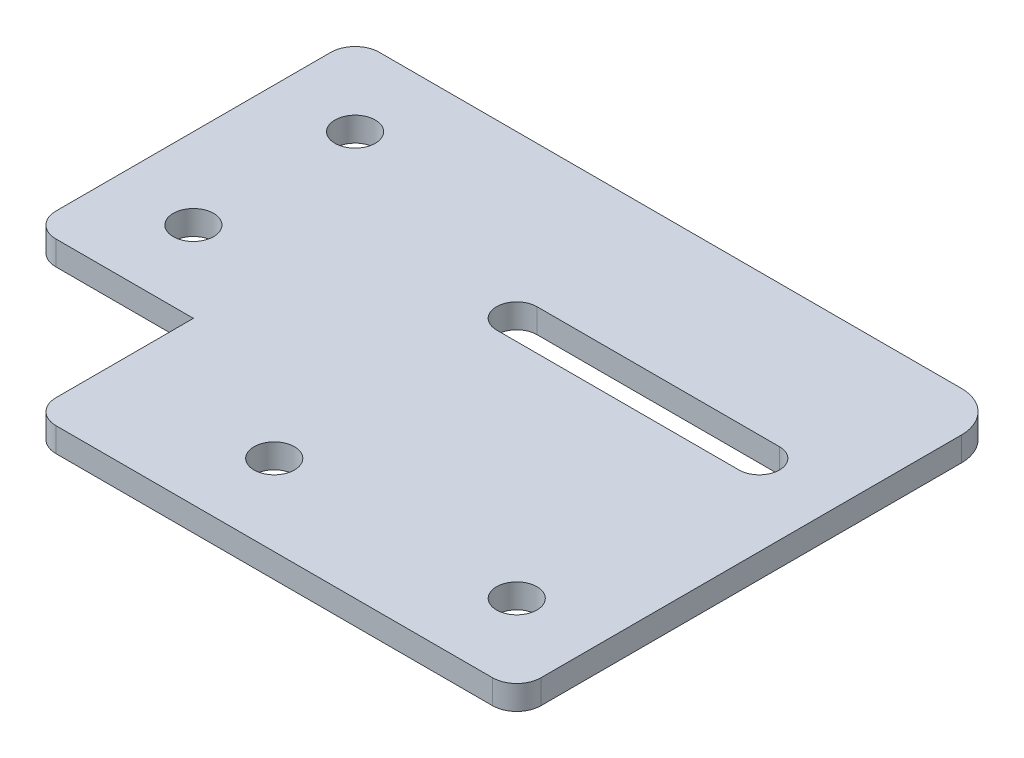
ISO-10303-21;
HEADER;
FILE_DESCRIPTION(('STEP AP214'),'2;1');
FILE_NAME('part.step','',(''),(''),'','','');
FILE_SCHEMA(('AUTOMOTIVE_DESIGN { 1 0 10303 214 1 1 1 1 }'));
ENDSEC;
DATA;
#1=APPLICATION_CONTEXT('core data for automotive mechanical design processes');
#2=APPLICATION_PROTOCOL_DEFINITION('international standard','automotive_design',2000,#1);
#3=PRODUCT_CONTEXT('',#1,'mechanical');
#4=PRODUCT('Part','Part','',(#3));
#5=PRODUCT_RELATED_PRODUCT_CATEGORY('part','',(#4));
#6=PRODUCT_DEFINITION_FORMATION('','',#4);
#7=PRODUCT_DEFINITION_CONTEXT('part definition',#1,'design');
#8=PRODUCT_DEFINITION('design','',#6,#7);
#9=PRODUCT_DEFINITION_SHAPE('','',#8);
#10=(LENGTH_UNIT() NAMED_UNIT(*) SI_UNIT(.MILLI.,.METRE.));
#11=(NAMED_UNIT(*) PLANE_ANGLE_UNIT() SI_UNIT($,.RADIAN.));
#12=(NAMED_UNIT(*) SI_UNIT($,.STERADIAN.) SOLID_ANGLE_UNIT());
#13=UNCERTAINTY_MEASURE_WITH_UNIT(LENGTH_MEASURE(1.E-05),#10,'distance_accuracy_value','');
#14=(GEOMETRIC_REPRESENTATION_CONTEXT(3) GLOBAL_UNCERTAINTY_ASSIGNED_CONTEXT((#13)) GLOBAL_UNIT_ASSIGNED_CONTEXT((#10,
#11,#12)) REPRESENTATION_CONTEXT('',''));
#15=CARTESIAN_POINT('',(0.,0.,0.));
#16=DIRECTION('',(0.,0.,1.));
#17=DIRECTION('',(1.,0.,0.));
#18=AXIS2_PLACEMENT_3D('',#15,#16,#17);
#19=CARTESIAN_POINT('',(23.,3.,0.416071827038649));
#20=DIRECTION('',(0.,-1.,0.));
#21=DIRECTION('',(0.,0.,-1.));
#22=AXIS2_PLACEMENT_3D('',#19,#20,#21);
#23=PLANE('',#22);
#24=CARTESIAN_POINT('',(10.,3.,-46.5839281729614));
#25=DIRECTION('',(0.,1.,0.));
#26=DIRECTION('',(0.,0.,1.));
#27=AXIS2_PLACEMENT_3D('',#24,#25,#26);
#28=CIRCLE('',#27,2.5);
#29=CARTESIAN_POINT('',(10.,3.,-44.0839281729614));
#30=VERTEX_POINT('',#29);
#31=EDGE_CURVE('E177',#30,#30,#28,.T.);
#32=ORIENTED_EDGE('',*,*,#31,.F.);
#33=EDGE_LOOP('',(#32));
#34=FACE_BOUND('',#33,.T.);
#35=CARTESIAN_POINT('',(70.,3.,-6.58392817296135));
#36=DIRECTION('',(0.,1.,0.));
#37=DIRECTION('',(0.,0.,1.));
#38=AXIS2_PLACEMENT_3D('',#35,#36,#37);
#39=CIRCLE('',#38,2.50000000000001);
#40=CARTESIAN_POINT('',(70.,3.,-4.08392817296135));
#41=VERTEX_POINT('',#40);
#42=EDGE_CURVE('E183',#41,#41,#39,.T.);
#43=ORIENTED_EDGE('',*,*,#42,.F.);
#44=EDGE_LOOP('',(#43));
#45=FACE_BOUND('',#44,.T.);
#46=CARTESIAN_POINT('',(40.,3.,-6.58392817296135));
#47=DIRECTION('',(0.,1.,0.));
#48=DIRECTION('',(0.,0.,1.));
#49=AXIS2_PLACEMENT_3D('',#46,#47,#48);
#50=CIRCLE('',#49,2.5);
#51=CARTESIAN_POINT('',(40.,3.,-4.08392817296135));
#52=VERTEX_POINT('',#51);
#53=EDGE_CURVE('E189',#52,#52,#50,.T.);
#54=ORIENTED_EDGE('',*,*,#53,.F.);
#55=EDGE_LOOP('',(#54));
#56=FACE_BOUND('',#55,.T.);
#57=CARTESIAN_POINT('',(10.,3.,-26.5839281729614));
#58=DIRECTION('',(0.,1.,0.));
#59=DIRECTION('',(0.,0.,1.));
#60=AXIS2_PLACEMENT_3D('',#57,#58,#59);
#61=CIRCLE('',#60,2.5);
#62=CARTESIAN_POINT('',(10.,3.,-24.0839281729614));
#63=VERTEX_POINT('',#62);
#64=EDGE_CURVE('E195',#63,#63,#61,.T.);
#65=ORIENTED_EDGE('',*,*,#64,.F.);
#66=EDGE_LOOP('',(#65));
#67=FACE_BOUND('',#66,.T.);
#68=DIRECTION('',(0.,0.,1.));
#69=VECTOR('',#68,1.);
#70=CARTESIAN_POINT('',(20.,3.,-16.5839281729614));
#71=LINE('',#70,#69);
#72=CARTESIAN_POINT('',(20.,3.,-16.5839281729614));
#73=VERTEX_POINT('',#72);
#74=CARTESIAN_POINT('',(20.,3.,0.416071827038628));
#75=VERTEX_POINT('',#74);
#76=EDGE_CURVE('E201',#73,#75,#71,.T.);
#77=ORIENTED_EDGE('',*,*,#76,.T.);
#78=CARTESIAN_POINT('',(23.,3.,0.416071827038649));
#79=DIRECTION('',(0.,1.,0.));
#80=DIRECTION('',(0.,0.,-1.));
#81=AXIS2_PLACEMENT_3D('',#78,#79,#80);
#82=CIRCLE('',#81,3.);
#83=CARTESIAN_POINT('',(23.,3.,3.41607182703865));
#84=VERTEX_POINT('',#83);
#85=EDGE_CURVE('E204',#75,#84,#82,.T.);
#86=ORIENTED_EDGE('',*,*,#85,.T.);
#87=DIRECTION('',(1.,0.,0.));
#88=VECTOR('',#87,1.);
#89=CARTESIAN_POINT('',(23.,3.,3.41607182703865));
#90=LINE('',#89,#88);
#91=CARTESIAN_POINT('',(77.,3.,3.41607182703865));
#92=VERTEX_POINT('',#91);
#93=EDGE_CURVE('E207',#84,#92,#90,.T.);
#94=ORIENTED_EDGE('',*,*,#93,.T.);
#95=CARTESIAN_POINT('',(77.,3.,0.41607182703865));
#96=DIRECTION('',(0.,1.,0.));
#97=DIRECTION('',(0.,0.,1.));
#98=AXIS2_PLACEMENT_3D('',#95,#96,#97);
#99=CIRCLE('',#98,3.);
#100=CARTESIAN_POINT('',(80.,3.,0.416071827038649));
#101=VERTEX_POINT('',#100);
#102=EDGE_CURVE('E209',#92,#101,#99,.T.);
#103=ORIENTED_EDGE('',*,*,#102,.T.);
#104=DIRECTION('',(0.,0.,-1.));
#105=VECTOR('',#104,1.);
#106=CARTESIAN_POINT('',(80.,3.,-51.5839281729614));
#107=LINE('',#106,#105);
#108=CARTESIAN_POINT('',(80.,3.,-51.5839281729614));
#109=VERTEX_POINT('',#108);
#110=EDGE_CURVE('E211',#101,#109,#107,.T.);
#111=ORIENTED_EDGE('',*,*,#110,.T.);
#112=CARTESIAN_POINT('',(75.,3.,-51.5839281729614));
#113=DIRECTION('',(0.,1.,0.));
#114=DIRECTION('',(0.,0.,1.));
#115=AXIS2_PLACEMENT_3D('',#112,#113,#114);
#116=CIRCLE('',#115,5.);
#117=CARTESIAN_POINT('',(75.,3.,-56.5839281729614));
#118=VERTEX_POINT('',#117);
#119=EDGE_CURVE('E213',#109,#118,#116,.T.);
#120=ORIENTED_EDGE('',*,*,#119,.T.);
#121=DIRECTION('',(-1.,0.,0.));
#122=VECTOR('',#121,1.);
#123=CARTESIAN_POINT('',(3.00000000000002,3.,-56.5839281729614));
#124=LINE('',#123,#122);
#125=CARTESIAN_POINT('',(3.00000000000002,3.,-56.5839281729614));
#126=VERTEX_POINT('',#125);
#127=EDGE_CURVE('E215',#118,#126,#124,.T.);
#128=ORIENTED_EDGE('',*,*,#127,.T.);
#129=CARTESIAN_POINT('',(3.,3.,-53.5839281729614));
#130=DIRECTION('',(0.,1.,0.));
#131=DIRECTION('',(0.,0.,-1.));
#132=AXIS2_PLACEMENT_3D('',#129,#130,#131);
#133=CIRCLE('',#132,3.);
#134=CARTESIAN_POINT('',(0.,3.,-53.5839281729613));
#135=VERTEX_POINT('',#134);
#136=EDGE_CURVE('E217',#126,#135,#133,.T.);
#137=ORIENTED_EDGE('',*,*,#136,.T.);
#138=DIRECTION('',(0.,0.,1.));
#139=VECTOR('',#138,1.);
#140=CARTESIAN_POINT('',(0.,3.,-19.5839281729614));
#141=LINE('',#140,#139);
#142=CARTESIAN_POINT('',(0.,3.,-19.5839281729614));
#143=VERTEX_POINT('',#142);
#144=EDGE_CURVE('E219',#135,#143,#141,.T.);
#145=ORIENTED_EDGE('',*,*,#144,.T.);
#146=CARTESIAN_POINT('',(3.,3.,-19.5839281729614));
#147=DIRECTION('',(0.,1.,0.));
#148=DIRECTION('',(0.,0.,-1.));
#149=AXIS2_PLACEMENT_3D('',#146,#147,#148);
#150=CIRCLE('',#149,3.);
#151=CARTESIAN_POINT('',(3.00000000000002,3.,-16.5839281729614));
#152=VERTEX_POINT('',#151);
#153=EDGE_CURVE('E221',#143,#152,#150,.T.);
#154=ORIENTED_EDGE('',*,*,#153,.T.);
#155=DIRECTION('',(1.,0.,0.));
#156=VECTOR('',#155,1.);
#157=CARTESIAN_POINT('',(3.00000000000002,3.,-16.5839281729614));
#158=LINE('',#157,#156);
#159=EDGE_CURVE('E223',#152,#73,#158,.T.);
#160=ORIENTED_EDGE('',*,*,#159,.T.);
#161=EDGE_LOOP('',(#77,#86,#94,#103,#111,#120,#128,#137,#145,#154,#160));
#162=FACE_BOUND('',#161,.T.);
#163=CARTESIAN_POINT('',(40.,3.,-36.5839281729614));
#164=DIRECTION('',(0.,1.,0.));
#165=DIRECTION('',(0.,0.,1.));
#166=AXIS2_PLACEMENT_3D('',#163,#164,#165);
#167=CIRCLE('',#166,2.5);
#168=CARTESIAN_POINT('',(40.,3.,-39.0839281729614));
#169=VERTEX_POINT('',#168);
#170=CARTESIAN_POINT('',(40.,3.,-34.0839281729614));
#171=VERTEX_POINT('',#170);
#172=EDGE_CURVE('E141',#169,#171,#167,.T.);
#173=ORIENTED_EDGE('',*,*,#172,.F.);
#174=DIRECTION('',(-1.,0.,0.));
#175=VECTOR('',#174,1.);
#176=CARTESIAN_POINT('',(40.,3.,-39.0839281729614));
#177=LINE('',#176,#175);
#178=CARTESIAN_POINT('',(70.,3.,-39.0839281729614));
#179=VERTEX_POINT('',#178);
#180=EDGE_CURVE('E163',#179,#169,#177,.T.);
#181=ORIENTED_EDGE('',*,*,#180,.F.);
#182=CARTESIAN_POINT('',(70.,3.,-36.5839281729614));
#183=DIRECTION('',(0.,1.,0.));
#184=DIRECTION('',(0.,0.,1.));
#185=AXIS2_PLACEMENT_3D('',#182,#183,#184);
#186=CIRCLE('',#185,2.5);
#187=CARTESIAN_POINT('',(70.,3.,-34.0839281729614));
#188=VERTEX_POINT('',#187);
#189=EDGE_CURVE('E161',#188,#179,#186,.T.);
#190=ORIENTED_EDGE('',*,*,#189,.F.);
#191=DIRECTION('',(1.,0.,0.));
#192=VECTOR('',#191,1.);
#193=CARTESIAN_POINT('',(40.,3.,-34.0839281729614));
#194=LINE('',#193,#192);
#195=EDGE_CURVE('E149',#171,#188,#194,.T.);
#196=ORIENTED_EDGE('',*,*,#195,.F.);
#197=EDGE_LOOP('',(#173,#181,#190,#196));
#198=FACE_BOUND('',#197,.T.);
#199=ADVANCED_FACE('F34',(#34,#45,#56,#67,#162,#198),#23,.F.);
#200=CARTESIAN_POINT('',(23.,0.,0.416071827038649));
#201=DIRECTION('',(0.,-1.,0.));
#202=DIRECTION('',(0.,0.,-1.));
#203=AXIS2_PLACEMENT_3D('',#200,#201,#202);
#204=PLANE('',#203);
#205=CARTESIAN_POINT('',(70.,0.,-6.58392817296135));
#206=DIRECTION('',(0.,1.,0.));
#207=DIRECTION('',(0.,0.,1.));
#208=AXIS2_PLACEMENT_3D('',#205,#206,#207);
#209=CIRCLE('',#208,2.50000000000001);
#210=CARTESIAN_POINT('',(70.,0.,-4.08392817296135));
#211=VERTEX_POINT('',#210);
#212=EDGE_CURVE('E180',#211,#211,#209,.T.);
#213=ORIENTED_EDGE('',*,*,#212,.T.);
#214=EDGE_LOOP('',(#213));
#215=FACE_BOUND('',#214,.T.);
#216=CARTESIAN_POINT('',(10.,0.,-26.5839281729614));
#217=DIRECTION('',(0.,1.,0.));
#218=DIRECTION('',(0.,0.,1.));
#219=AXIS2_PLACEMENT_3D('',#216,#217,#218);
#220=CIRCLE('',#219,2.5);
#221=CARTESIAN_POINT('',(10.,0.,-24.0839281729614));
#222=VERTEX_POINT('',#221);
#223=EDGE_CURVE('E192',#222,#222,#220,.T.);
#224=ORIENTED_EDGE('',*,*,#223,.T.);
#225=EDGE_LOOP('',(#224));
#226=FACE_BOUND('',#225,.T.);
#227=DIRECTION('',(0.,0.,1.));
#228=VECTOR('',#227,1.);
#229=CARTESIAN_POINT('',(20.,0.,-16.5839281729614));
#230=LINE('',#229,#228);
#231=CARTESIAN_POINT('',(20.,0.,-16.5839281729614));
#232=VERTEX_POINT('',#231);
#233=CARTESIAN_POINT('',(20.,0.,0.416071827038628));
#234=VERTEX_POINT('',#233);
#235=EDGE_CURVE('E198',#232,#234,#230,.T.);
#236=ORIENTED_EDGE('',*,*,#235,.F.);
#237=DIRECTION('',(1.,0.,0.));
#238=VECTOR('',#237,1.);
#239=CARTESIAN_POINT('',(3.00000000000002,0.,-16.5839281729614));
#240=LINE('',#239,#238);
#241=CARTESIAN_POINT('',(3.00000000000002,0.,-16.5839281729614));
#242=VERTEX_POINT('',#241);
#243=EDGE_CURVE('E205',#242,#232,#240,.T.);
#244=ORIENTED_EDGE('',*,*,#243,.F.);
#245=CARTESIAN_POINT('',(3.,0.,-19.5839281729614));
#246=DIRECTION('',(0.,1.,0.));
#247=DIRECTION('',(0.,0.,-1.));
#248=AXIS2_PLACEMENT_3D('',#245,#246,#247);
#249=CIRCLE('',#248,3.);
#250=CARTESIAN_POINT('',(0.,0.,-19.5839281729614));
#251=VERTEX_POINT('',#250);
#252=EDGE_CURVE('E244',#251,#242,#249,.T.);
#253=ORIENTED_EDGE('',*,*,#252,.F.);
#254=DIRECTION('',(0.,0.,1.));
#255=VECTOR('',#254,1.);
#256=CARTESIAN_POINT('',(0.,0.,-19.5839281729614));
#257=LINE('',#256,#255);
#258=CARTESIAN_POINT('',(0.,0.,-53.5839281729613));
#259=VERTEX_POINT('',#258);
#260=EDGE_CURVE('E242',#259,#251,#257,.T.);
#261=ORIENTED_EDGE('',*,*,#260,.F.);
#262=CARTESIAN_POINT('',(3.,0.,-53.5839281729614));
#263=DIRECTION('',(0.,1.,0.));
#264=DIRECTION('',(0.,0.,-1.));
#265=AXIS2_PLACEMENT_3D('',#262,#263,#264);
#266=CIRCLE('',#265,3.);
#267=CARTESIAN_POINT('',(3.00000000000002,0.,-56.5839281729614));
#268=VERTEX_POINT('',#267);
#269=EDGE_CURVE('E240',#268,#259,#266,.T.);
#270=ORIENTED_EDGE('',*,*,#269,.F.);
#271=DIRECTION('',(-1.,0.,0.));
#272=VECTOR('',#271,1.);
#273=CARTESIAN_POINT('',(3.00000000000002,0.,-56.5839281729614));
#274=LINE('',#273,#272);
#275=CARTESIAN_POINT('',(75.,0.,-56.5839281729614));
#276=VERTEX_POINT('',#275);
#277=EDGE_CURVE('E238',#276,#268,#274,.T.);
#278=ORIENTED_EDGE('',*,*,#277,.F.);
#279=CARTESIAN_POINT('',(75.,0.,-51.5839281729614));
#280=DIRECTION('',(0.,1.,0.));
#281=DIRECTION('',(0.,0.,1.));
#282=AXIS2_PLACEMENT_3D('',#279,#280,#281);
#283=CIRCLE('',#282,5.);
#284=CARTESIAN_POINT('',(80.,0.,-51.5839281729614));
#285=VERTEX_POINT('',#284);
#286=EDGE_CURVE('E236',#285,#276,#283,.T.);
#287=ORIENTED_EDGE('',*,*,#286,.F.);
#288=DIRECTION('',(0.,0.,-1.));
#289=VECTOR('',#288,1.);
#290=CARTESIAN_POINT('',(80.,0.,-51.5839281729614));
#291=LINE('',#290,#289);
#292=CARTESIAN_POINT('',(80.,0.,0.416071827038649));
#293=VERTEX_POINT('',#292);
#294=EDGE_CURVE('E234',#293,#285,#291,.T.);
#295=ORIENTED_EDGE('',*,*,#294,.F.);
#296=CARTESIAN_POINT('',(77.,0.,0.41607182703865));
#297=DIRECTION('',(0.,1.,0.));
#298=DIRECTION('',(0.,0.,1.));
#299=AXIS2_PLACEMENT_3D('',#296,#297,#298);
#300=CIRCLE('',#299,3.);
#301=CARTESIAN_POINT('',(77.,0.,3.41607182703865));
#302=VERTEX_POINT('',#301);
#303=EDGE_CURVE('E232',#302,#293,#300,.T.);
#304=ORIENTED_EDGE('',*,*,#303,.F.);
#305=DIRECTION('',(1.,0.,0.));
#306=VECTOR('',#305,1.);
#307=CARTESIAN_POINT('',(23.,0.,3.41607182703865));
#308=LINE('',#307,#306);
#309=CARTESIAN_POINT('',(23.,0.,3.41607182703865));
#310=VERTEX_POINT('',#309);
#311=EDGE_CURVE('E230',#310,#302,#308,.T.);
#312=ORIENTED_EDGE('',*,*,#311,.F.);
#313=CARTESIAN_POINT('',(23.,0.,0.416071827038649));
#314=DIRECTION('',(0.,1.,0.));
#315=DIRECTION('',(0.,0.,-1.));
#316=AXIS2_PLACEMENT_3D('',#313,#314,#315);
#317=CIRCLE('',#316,3.);
#318=EDGE_CURVE('E228',#234,#310,#317,.T.);
#319=ORIENTED_EDGE('',*,*,#318,.F.);
#320=EDGE_LOOP('',(#236,#244,#253,#261,#270,#278,#287,#295,#304,#312,#319));
#321=FACE_BOUND('',#320,.T.);
#322=CARTESIAN_POINT('',(40.,0.,-6.58392817296135));
#323=DIRECTION('',(0.,1.,0.));
#324=DIRECTION('',(0.,0.,1.));
#325=AXIS2_PLACEMENT_3D('',#322,#323,#324);
#326=CIRCLE('',#325,2.5);
#327=CARTESIAN_POINT('',(40.,0.,-4.08392817296135));
#328=VERTEX_POINT('',#327);
#329=EDGE_CURVE('E186',#328,#328,#326,.T.);
#330=ORIENTED_EDGE('',*,*,#329,.T.);
#331=EDGE_LOOP('',(#330));
#332=FACE_BOUND('',#331,.T.);
#333=CARTESIAN_POINT('',(10.,0.,-46.5839281729614));
#334=DIRECTION('',(0.,1.,0.));
#335=DIRECTION('',(0.,0.,1.));
#336=AXIS2_PLACEMENT_3D('',#333,#334,#335);
#337=CIRCLE('',#336,2.5);
#338=CARTESIAN_POINT('',(10.,0.,-44.0839281729614));
#339=VERTEX_POINT('',#338);
#340=EDGE_CURVE('E157',#339,#339,#337,.T.);
#341=ORIENTED_EDGE('',*,*,#340,.T.);
#342=EDGE_LOOP('',(#341));
#343=FACE_BOUND('',#342,.T.);
#344=DIRECTION('',(-1.,0.,0.));
#345=VECTOR('',#344,1.);
#346=CARTESIAN_POINT('',(40.,0.,-39.0839281729614));
#347=LINE('',#346,#345);
#348=CARTESIAN_POINT('',(70.,0.,-39.0839281729614));
#349=VERTEX_POINT('',#348);
#350=CARTESIAN_POINT('',(40.,0.,-39.0839281729614));
#351=VERTEX_POINT('',#350);
#352=EDGE_CURVE('E150',#349,#351,#347,.T.);
#353=ORIENTED_EDGE('',*,*,#352,.T.);
#354=CARTESIAN_POINT('',(40.,0.,-36.5839281729614));
#355=DIRECTION('',(0.,1.,0.));
#356=DIRECTION('',(0.,0.,1.));
#357=AXIS2_PLACEMENT_3D('',#354,#355,#356);
#358=CIRCLE('',#357,2.5);
#359=CARTESIAN_POINT('',(40.,0.,-34.0839281729614));
#360=VERTEX_POINT('',#359);
#361=EDGE_CURVE('E57',#351,#360,#358,.T.);
#362=ORIENTED_EDGE('',*,*,#361,.T.);
#363=DIRECTION('',(1.,0.,0.));
#364=VECTOR('',#363,1.);
#365=CARTESIAN_POINT('',(40.,0.,-34.0839281729614));
#366=LINE('',#365,#364);
#367=CARTESIAN_POINT('',(70.,0.,-34.0839281729614));
#368=VERTEX_POINT('',#367);
#369=EDGE_CURVE('E156',#360,#368,#366,.T.);
#370=ORIENTED_EDGE('',*,*,#369,.T.);
#371=CARTESIAN_POINT('',(70.,0.,-36.5839281729614));
#372=DIRECTION('',(0.,1.,0.));
#373=DIRECTION('',(0.,0.,1.));
#374=AXIS2_PLACEMENT_3D('',#371,#372,#373);
#375=CIRCLE('',#374,2.5);
#376=EDGE_CURVE('E169',#368,#349,#375,.T.);
#377=ORIENTED_EDGE('',*,*,#376,.T.);
#378=EDGE_LOOP('',(#353,#362,#370,#377));
#379=FACE_BOUND('',#378,.T.);
#380=ADVANCED_FACE('F283',(#215,#226,#321,#332,#343,#379),#204,.T.);
#381=CARTESIAN_POINT('',(20.,3.,-16.5839281729614));
#382=DIRECTION('',(1.,0.,0.));
#383=DIRECTION('',(0.,0.,-1.));
#384=AXIS2_PLACEMENT_3D('',#381,#382,#383);
#385=PLANE('',#384);
#386=ORIENTED_EDGE('',*,*,#235,.T.);
#387=DIRECTION('',(0.,-1.,0.));
#388=VECTOR('',#387,1.);
#389=CARTESIAN_POINT('',(20.,3.,0.416071827038628));
#390=LINE('',#389,#388);
#391=EDGE_CURVE('E11',#75,#234,#390,.T.);
#392=ORIENTED_EDGE('',*,*,#391,.F.);
#393=ORIENTED_EDGE('',*,*,#76,.F.);
#394=DIRECTION('',(0.,-1.,0.));
#395=VECTOR('',#394,1.);
#396=CARTESIAN_POINT('',(20.,3.,-16.5839281729614));
#397=LINE('',#396,#395);
#398=EDGE_CURVE('E225',#73,#232,#397,.T.);
#399=ORIENTED_EDGE('',*,*,#398,.T.);
#400=EDGE_LOOP('',(#386,#392,#393,#399));
#401=FACE_BOUND('',#400,.T.);
#402=ADVANCED_FACE('F36',(#401),#385,.F.);
#403=CARTESIAN_POINT('',(23.,3.,0.416071827038649));
#404=DIRECTION('',(0.,-1.,0.));
#405=DIRECTION('',(0.,0.,-1.));
#406=AXIS2_PLACEMENT_3D('',#403,#404,#405);
#407=CYLINDRICAL_SURFACE('',#406,3.);
#408=ORIENTED_EDGE('',*,*,#318,.T.);
#409=DIRECTION('',(0.,-1.,0.));
#410=VECTOR('',#409,1.);
#411=CARTESIAN_POINT('',(23.,3.,3.41607182703865));
#412=LINE('',#411,#410);
#413=EDGE_CURVE('E42',#84,#310,#412,.T.);
#414=ORIENTED_EDGE('',*,*,#413,.F.);
#415=ORIENTED_EDGE('',*,*,#85,.F.);
#416=ORIENTED_EDGE('',*,*,#391,.T.);
#417=EDGE_LOOP('',(#408,#414,#415,#416));
#418=FACE_BOUND('',#417,.T.);
#419=ADVANCED_FACE('F300',(#418),#407,.T.);
#420=CARTESIAN_POINT('',(23.,3.,3.41607182703865));
#421=DIRECTION('',(0.,0.,-1.));
#422=DIRECTION('',(-1.,0.,0.));
#423=AXIS2_PLACEMENT_3D('',#420,#421,#422);
#424=PLANE('',#423);
#425=ORIENTED_EDGE('',*,*,#311,.T.);
#426=DIRECTION('',(0.,-1.,0.));
#427=VECTOR('',#426,1.);
#428=CARTESIAN_POINT('',(77.,3.,3.41607182703865));
#429=LINE('',#428,#427);
#430=EDGE_CURVE('E270',#92,#302,#429,.T.);
#431=ORIENTED_EDGE('',*,*,#430,.F.);
#432=ORIENTED_EDGE('',*,*,#93,.F.);
#433=ORIENTED_EDGE('',*,*,#413,.T.);
#434=EDGE_LOOP('',(#425,#431,#432,#433));
#435=FACE_BOUND('',#434,.T.);
#436=ADVANCED_FACE('F277',(#435),#424,.F.);
#437=CARTESIAN_POINT('',(77.,3.,0.41607182703865));
#438=DIRECTION('',(0.,-1.,0.));
#439=DIRECTION('',(0.,0.,-1.));
#440=AXIS2_PLACEMENT_3D('',#437,#438,#439);
#441=CYLINDRICAL_SURFACE('',#440,3.);
#442=ORIENTED_EDGE('',*,*,#303,.T.);
#443=DIRECTION('',(0.,-1.,0.));
#444=VECTOR('',#443,1.);
#445=CARTESIAN_POINT('',(80.,3.,0.416071827038649));
#446=LINE('',#445,#444);
#447=EDGE_CURVE('E267',#101,#293,#446,.T.);
#448=ORIENTED_EDGE('',*,*,#447,.F.);
#449=ORIENTED_EDGE('',*,*,#102,.F.);
#450=ORIENTED_EDGE('',*,*,#430,.T.);
#451=EDGE_LOOP('',(#442,#448,#449,#450));
#452=FACE_BOUND('',#451,.T.);
#453=ADVANCED_FACE('F289',(#452),#441,.T.);
#454=CARTESIAN_POINT('',(80.,3.,-51.5839281729614));
#455=DIRECTION('',(-1.,0.,0.));
#456=DIRECTION('',(0.,0.,1.));
#457=AXIS2_PLACEMENT_3D('',#454,#455,#456);
#458=PLANE('',#457);
#459=ORIENTED_EDGE('',*,*,#294,.T.);
#460=DIRECTION('',(0.,-1.,0.));
#461=VECTOR('',#460,1.);
#462=CARTESIAN_POINT('',(80.,3.,-51.5839281729614));
#463=LINE('',#462,#461);
#464=EDGE_CURVE('E264',#109,#285,#463,.T.);
#465=ORIENTED_EDGE('',*,*,#464,.F.);
#466=ORIENTED_EDGE('',*,*,#110,.F.);
#467=ORIENTED_EDGE('',*,*,#447,.T.);
#468=EDGE_LOOP('',(#459,#465,#466,#467));
#469=FACE_BOUND('',#468,.T.);
#470=ADVANCED_FACE('F293',(#469),#458,.F.);
#471=CARTESIAN_POINT('',(75.,3.,-51.5839281729614));
#472=DIRECTION('',(0.,-1.,0.));
#473=DIRECTION('',(0.,0.,-1.));
#474=AXIS2_PLACEMENT_3D('',#471,#472,#473);
#475=CYLINDRICAL_SURFACE('',#474,5.);
#476=ORIENTED_EDGE('',*,*,#286,.T.);
#477=DIRECTION('',(0.,-1.,0.));
#478=VECTOR('',#477,1.);
#479=CARTESIAN_POINT('',(75.,3.,-56.5839281729614));
#480=LINE('',#479,#478);
#481=EDGE_CURVE('E261',#118,#276,#480,.T.);
#482=ORIENTED_EDGE('',*,*,#481,.F.);
#483=ORIENTED_EDGE('',*,*,#119,.F.);
#484=ORIENTED_EDGE('',*,*,#464,.T.);
#485=EDGE_LOOP('',(#476,#482,#483,#484));
#486=FACE_BOUND('',#485,.T.);
#487=ADVANCED_FACE('F328',(#486),#475,.T.);
#488=CARTESIAN_POINT('',(3.00000000000002,3.,-56.5839281729614));
#489=DIRECTION('',(0.,0.,1.));
#490=DIRECTION('',(1.,0.,0.));
#491=AXIS2_PLACEMENT_3D('',#488,#489,#490);
#492=PLANE('',#491);
#493=ORIENTED_EDGE('',*,*,#277,.T.);
#494=DIRECTION('',(0.,-1.,0.));
#495=VECTOR('',#494,1.);
#496=CARTESIAN_POINT('',(3.00000000000002,3.,-56.5839281729614));
#497=LINE('',#496,#495);
#498=EDGE_CURVE('E258',#126,#268,#497,.T.);
#499=ORIENTED_EDGE('',*,*,#498,.F.);
#500=ORIENTED_EDGE('',*,*,#127,.F.);
#501=ORIENTED_EDGE('',*,*,#481,.T.);
#502=EDGE_LOOP('',(#493,#499,#500,#501));
#503=FACE_BOUND('',#502,.T.);
#504=ADVANCED_FACE('F326',(#503),#492,.F.);
#505=CARTESIAN_POINT('',(3.,3.,-53.5839281729614));
#506=DIRECTION('',(0.,-1.,0.));
#507=DIRECTION('',(0.,0.,-1.));
#508=AXIS2_PLACEMENT_3D('',#505,#506,#507);
#509=CYLINDRICAL_SURFACE('',#508,3.);
#510=ORIENTED_EDGE('',*,*,#269,.T.);
#511=DIRECTION('',(0.,-1.,0.));
#512=VECTOR('',#511,1.);
#513=CARTESIAN_POINT('',(0.,3.,-53.5839281729613));
#514=LINE('',#513,#512);
#515=EDGE_CURVE('E255',#135,#259,#514,.T.);
#516=ORIENTED_EDGE('',*,*,#515,.F.);
#517=ORIENTED_EDGE('',*,*,#136,.F.);
#518=ORIENTED_EDGE('',*,*,#498,.T.);
#519=EDGE_LOOP('',(#510,#516,#517,#518));
#520=FACE_BOUND('',#519,.T.);
#521=ADVANCED_FACE('F321',(#520),#509,.T.);
#522=CARTESIAN_POINT('',(0.,3.,-19.5839281729614));
#523=DIRECTION('',(1.,0.,0.));
#524=DIRECTION('',(0.,0.,-1.));
#525=AXIS2_PLACEMENT_3D('',#522,#523,#524);
#526=PLANE('',#525);
#527=ORIENTED_EDGE('',*,*,#260,.T.);
#528=DIRECTION('',(0.,-1.,0.));
#529=VECTOR('',#528,1.);
#530=CARTESIAN_POINT('',(0.,3.,-19.5839281729614));
#531=LINE('',#530,#529);
#532=EDGE_CURVE('E252',#143,#251,#531,.T.);
#533=ORIENTED_EDGE('',*,*,#532,.F.);
#534=ORIENTED_EDGE('',*,*,#144,.F.);
#535=ORIENTED_EDGE('',*,*,#515,.T.);
#536=EDGE_LOOP('',(#527,#533,#534,#535));
#537=FACE_BOUND('',#536,.T.);
#538=ADVANCED_FACE('F316',(#537),#526,.F.);
#539=CARTESIAN_POINT('',(3.,3.,-19.5839281729614));
#540=DIRECTION('',(0.,-1.,0.));
#541=DIRECTION('',(0.,0.,-1.));
#542=AXIS2_PLACEMENT_3D('',#539,#540,#541);
#543=CYLINDRICAL_SURFACE('',#542,3.);
#544=ORIENTED_EDGE('',*,*,#252,.T.);
#545=DIRECTION('',(0.,-1.,0.));
#546=VECTOR('',#545,1.);
#547=CARTESIAN_POINT('',(3.00000000000002,3.,-16.5839281729614));
#548=LINE('',#547,#546);
#549=EDGE_CURVE('E249',#152,#242,#548,.T.);
#550=ORIENTED_EDGE('',*,*,#549,.F.);
#551=ORIENTED_EDGE('',*,*,#153,.F.);
#552=ORIENTED_EDGE('',*,*,#532,.T.);
#553=EDGE_LOOP('',(#544,#550,#551,#552));
#554=FACE_BOUND('',#553,.T.);
#555=ADVANCED_FACE('F312',(#554),#543,.T.);
#556=CARTESIAN_POINT('',(3.00000000000002,3.,-16.5839281729614));
#557=DIRECTION('',(0.,0.,-1.));
#558=DIRECTION('',(-1.,0.,0.));
#559=AXIS2_PLACEMENT_3D('',#556,#557,#558);
#560=PLANE('',#559);
#561=ORIENTED_EDGE('',*,*,#243,.T.);
#562=ORIENTED_EDGE('',*,*,#398,.F.);
#563=ORIENTED_EDGE('',*,*,#159,.F.);
#564=ORIENTED_EDGE('',*,*,#549,.T.);
#565=EDGE_LOOP('',(#561,#562,#563,#564));
#566=FACE_BOUND('',#565,.T.);
#567=ADVANCED_FACE('F307',(#566),#560,.F.);
#568=CARTESIAN_POINT('',(10.,3.,-26.5839281729614));
#569=DIRECTION('',(0.,-1.,0.));
#570=DIRECTION('',(0.,0.,-1.));
#571=AXIS2_PLACEMENT_3D('',#568,#569,#570);
#572=CYLINDRICAL_SURFACE('',#571,2.5);
#573=ORIENTED_EDGE('',*,*,#64,.T.);
#574=EDGE_LOOP('',(#573));
#575=FACE_BOUND('',#574,.T.);
#576=ORIENTED_EDGE('',*,*,#223,.F.);
#577=EDGE_LOOP('',(#576));
#578=FACE_BOUND('',#577,.T.);
#579=ADVANCED_FACE('F348',(#575,#578),#572,.F.);
#580=CARTESIAN_POINT('',(40.,3.,-6.58392817296135));
#581=DIRECTION('',(0.,-1.,0.));
#582=DIRECTION('',(0.,0.,-1.));
#583=AXIS2_PLACEMENT_3D('',#580,#581,#582);
#584=CYLINDRICAL_SURFACE('',#583,2.5);
#585=ORIENTED_EDGE('',*,*,#53,.T.);
#586=EDGE_LOOP('',(#585));
#587=FACE_BOUND('',#586,.T.);
#588=ORIENTED_EDGE('',*,*,#329,.F.);
#589=EDGE_LOOP('',(#588));
#590=FACE_BOUND('',#589,.T.);
#591=ADVANCED_FACE('F380',(#587,#590),#584,.F.);
#592=CARTESIAN_POINT('',(70.,3.,-6.58392817296135));
#593=DIRECTION('',(0.,-1.,0.));
#594=DIRECTION('',(0.,0.,-1.));
#595=AXIS2_PLACEMENT_3D('',#592,#593,#594);
#596=CYLINDRICAL_SURFACE('',#595,2.50000000000001);
#597=ORIENTED_EDGE('',*,*,#42,.T.);
#598=EDGE_LOOP('',(#597));
#599=FACE_BOUND('',#598,.T.);
#600=ORIENTED_EDGE('',*,*,#212,.F.);
#601=EDGE_LOOP('',(#600));
#602=FACE_BOUND('',#601,.T.);
#603=ADVANCED_FACE('F387',(#599,#602),#596,.F.);
#604=CARTESIAN_POINT('',(10.,3.,-46.5839281729614));
#605=DIRECTION('',(0.,-1.,0.));
#606=DIRECTION('',(0.,0.,-1.));
#607=AXIS2_PLACEMENT_3D('',#604,#605,#606);
#608=CYLINDRICAL_SURFACE('',#607,2.5);
#609=ORIENTED_EDGE('',*,*,#31,.T.);
#610=EDGE_LOOP('',(#609));
#611=FACE_BOUND('',#610,.T.);
#612=ORIENTED_EDGE('',*,*,#340,.F.);
#613=EDGE_LOOP('',(#612));
#614=FACE_BOUND('',#613,.T.);
#615=ADVANCED_FACE('F394',(#611,#614),#608,.F.);
#616=CARTESIAN_POINT('',(40.,3.,-36.5839281729614));
#617=DIRECTION('',(0.,-1.,0.));
#618=DIRECTION('',(0.,0.,-1.));
#619=AXIS2_PLACEMENT_3D('',#616,#617,#618);
#620=CYLINDRICAL_SURFACE('',#619,2.5);
#621=ORIENTED_EDGE('',*,*,#361,.F.);
#622=DIRECTION('',(0.,-1.,0.));
#623=VECTOR('',#622,1.);
#624=CARTESIAN_POINT('',(40.,3.,-39.0839281729614));
#625=LINE('',#624,#623);
#626=EDGE_CURVE('E145',#169,#351,#625,.T.);
#627=ORIENTED_EDGE('',*,*,#626,.F.);
#628=ORIENTED_EDGE('',*,*,#172,.T.);
#629=DIRECTION('',(0.,-1.,0.));
#630=VECTOR('',#629,1.);
#631=CARTESIAN_POINT('',(40.,3.,-34.0839281729614));
#632=LINE('',#631,#630);
#633=EDGE_CURVE('E144',#171,#360,#632,.T.);
#634=ORIENTED_EDGE('',*,*,#633,.T.);
#635=EDGE_LOOP('',(#621,#627,#628,#634));
#636=FACE_BOUND('',#635,.T.);
#637=ADVANCED_FACE('F143',(#636),#620,.F.);
#638=CARTESIAN_POINT('',(40.,3.,-34.0839281729614));
#639=DIRECTION('',(0.,0.,-1.));
#640=DIRECTION('',(-1.,0.,0.));
#641=AXIS2_PLACEMENT_3D('',#638,#639,#640);
#642=PLANE('',#641);
#643=ORIENTED_EDGE('',*,*,#369,.F.);
#644=ORIENTED_EDGE('',*,*,#633,.F.);
#645=ORIENTED_EDGE('',*,*,#195,.T.);
#646=DIRECTION('',(0.,-1.,0.));
#647=VECTOR('',#646,1.);
#648=CARTESIAN_POINT('',(70.,3.,-34.0839281729614));
#649=LINE('',#648,#647);
#650=EDGE_CURVE('E158',#188,#368,#649,.T.);
#651=ORIENTED_EDGE('',*,*,#650,.T.);
#652=EDGE_LOOP('',(#643,#644,#645,#651));
#653=FACE_BOUND('',#652,.T.);
#654=ADVANCED_FACE('F153',(#653),#642,.T.);
#655=CARTESIAN_POINT('',(70.,3.,-36.5839281729614));
#656=DIRECTION('',(0.,-1.,0.));
#657=DIRECTION('',(0.,0.,-1.));
#658=AXIS2_PLACEMENT_3D('',#655,#656,#657);
#659=CYLINDRICAL_SURFACE('',#658,2.5);
#660=ORIENTED_EDGE('',*,*,#376,.F.);
#661=ORIENTED_EDGE('',*,*,#650,.F.);
#662=ORIENTED_EDGE('',*,*,#189,.T.);
#663=DIRECTION('',(0.,-1.,0.));
#664=VECTOR('',#663,1.);
#665=CARTESIAN_POINT('',(70.,3.,-39.0839281729614));
#666=LINE('',#665,#664);
#667=EDGE_CURVE('E49',#179,#349,#666,.T.);
#668=ORIENTED_EDGE('',*,*,#667,.T.);
#669=EDGE_LOOP('',(#660,#661,#662,#668));
#670=FACE_BOUND('',#669,.T.);
#671=ADVANCED_FACE('F415',(#670),#659,.F.);
#672=CARTESIAN_POINT('',(40.,3.,-39.0839281729614));
#673=DIRECTION('',(0.,0.,1.));
#674=DIRECTION('',(1.,0.,0.));
#675=AXIS2_PLACEMENT_3D('',#672,#673,#674);
#676=PLANE('',#675);
#677=ORIENTED_EDGE('',*,*,#352,.F.);
#678=ORIENTED_EDGE('',*,*,#667,.F.);
#679=ORIENTED_EDGE('',*,*,#180,.T.);
#680=ORIENTED_EDGE('',*,*,#626,.T.);
#681=EDGE_LOOP('',(#677,#678,#679,#680));
#682=FACE_BOUND('',#681,.T.);
#683=ADVANCED_FACE('F422',(#682),#676,.T.);
#684=CLOSED_SHELL('',(#199,#380,#402,#419,#436,#453,#470,#487,#504,#521,#538,#555,#567,#579,
#591,#603,#615,#637,#654,#671,#683));
#685=MANIFOLD_SOLID_BREP('B2',#684);
#686=ADVANCED_BREP_SHAPE_REPRESENTATION('',(#18,#685),#14);
#687=SHAPE_DEFINITION_REPRESENTATION(#9,#686);
ENDSEC;
END-ISO-10303-21;
